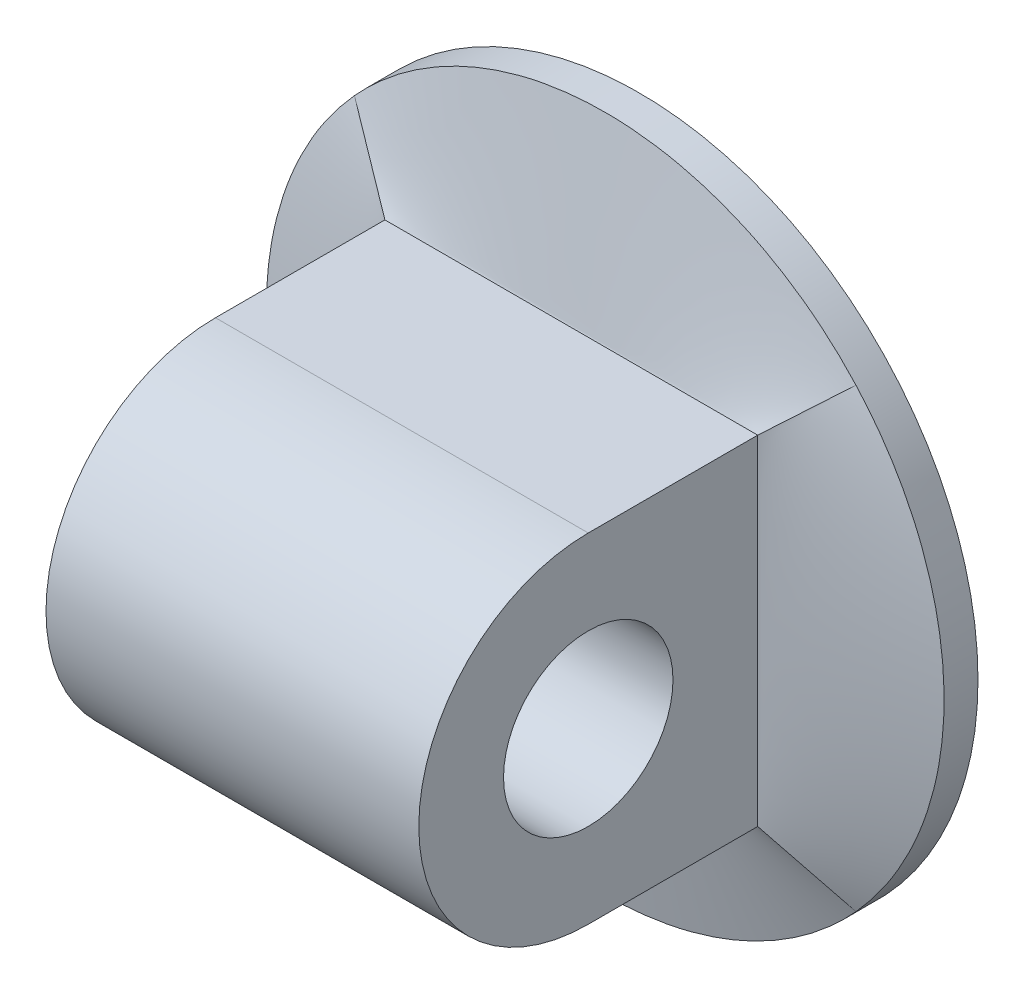
ISO-10303-21;
HEADER;
FILE_DESCRIPTION(('STEP AP214'),'2;1');
FILE_NAME('part.step','',(''),(''),'','','');
FILE_SCHEMA(('AUTOMOTIVE_DESIGN { 1 0 10303 214 1 1 1 1 }'));
ENDSEC;
DATA;
#1=APPLICATION_CONTEXT('core data for automotive mechanical design processes');
#2=APPLICATION_PROTOCOL_DEFINITION('international standard','automotive_design',2000,#1);
#3=PRODUCT_CONTEXT('',#1,'mechanical');
#4=PRODUCT('Part','Part','',(#3));
#5=PRODUCT_RELATED_PRODUCT_CATEGORY('part','',(#4));
#6=PRODUCT_DEFINITION_FORMATION('','',#4);
#7=PRODUCT_DEFINITION_CONTEXT('part definition',#1,'design');
#8=PRODUCT_DEFINITION('design','',#6,#7);
#9=PRODUCT_DEFINITION_SHAPE('','',#8);
#10=(LENGTH_UNIT() NAMED_UNIT(*) SI_UNIT(.MILLI.,.METRE.));
#11=(NAMED_UNIT(*) PLANE_ANGLE_UNIT() SI_UNIT($,.RADIAN.));
#12=(NAMED_UNIT(*) SI_UNIT($,.STERADIAN.) SOLID_ANGLE_UNIT());
#13=UNCERTAINTY_MEASURE_WITH_UNIT(LENGTH_MEASURE(1.E-05),#10,'distance_accuracy_value','');
#14=(GEOMETRIC_REPRESENTATION_CONTEXT(3) GLOBAL_UNCERTAINTY_ASSIGNED_CONTEXT((#13)) GLOBAL_UNIT_ASSIGNED_CONTEXT((#10,
#11,#12)) REPRESENTATION_CONTEXT('',''));
#15=CARTESIAN_POINT('',(0.,0.,0.));
#16=DIRECTION('',(0.,0.,1.));
#17=DIRECTION('',(1.,0.,0.));
#18=AXIS2_PLACEMENT_3D('',#15,#16,#17);
#19=CARTESIAN_POINT('',(-13.97,-12.7,30.48));
#20=DIRECTION('',(0.,1.,0.));
#21=DIRECTION('',(0.,0.,1.));
#22=AXIS2_PLACEMENT_3D('',#19,#20,#21);
#23=PLANE('',#22);
#24=DIRECTION('',(1.,0.,0.));
#25=VECTOR('',#24,1.);
#26=CARTESIAN_POINT('',(-25.4,-12.7,17.78));
#27=LINE('',#26,#25);
#28=CARTESIAN_POINT('',(-13.97,-12.7,17.78));
#29=VERTEX_POINT('',#28);
#30=CARTESIAN_POINT('',(13.97,-12.7,17.78));
#31=VERTEX_POINT('',#30);
#32=EDGE_CURVE('E129',#29,#31,#27,.T.);
#33=ORIENTED_EDGE('',*,*,#32,.F.);
#34=DIRECTION('',(0.,0.,-1.));
#35=VECTOR('',#34,1.);
#36=CARTESIAN_POINT('',(-13.97,-12.7,30.48));
#37=LINE('',#36,#35);
#38=CARTESIAN_POINT('',(-13.97,-12.7,5.08));
#39=VERTEX_POINT('',#38);
#40=EDGE_CURVE('E146',#29,#39,#37,.T.);
#41=ORIENTED_EDGE('',*,*,#40,.T.);
#42=DIRECTION('',(1.,0.,0.));
#43=VECTOR('',#42,1.);
#44=CARTESIAN_POINT('',(-13.97,-12.7,5.08));
#45=LINE('',#44,#43);
#46=CARTESIAN_POINT('',(13.97,-12.7,5.08));
#47=VERTEX_POINT('',#46);
#48=EDGE_CURVE('E140',#39,#47,#45,.T.);
#49=ORIENTED_EDGE('',*,*,#48,.T.);
#50=DIRECTION('',(0.,0.,-1.));
#51=VECTOR('',#50,1.);
#52=CARTESIAN_POINT('',(13.97,-12.7,30.48));
#53=LINE('',#52,#51);
#54=EDGE_CURVE('E66',#31,#47,#53,.T.);
#55=ORIENTED_EDGE('',*,*,#54,.F.);
#56=EDGE_LOOP('',(#33,#41,#49,#55));
#57=FACE_BOUND('',#56,.T.);
#58=ADVANCED_FACE('F61',(#57),#23,.F.);
#59=CARTESIAN_POINT('',(13.97,-12.7,30.48));
#60=DIRECTION('',(-1.,0.,0.));
#61=DIRECTION('',(0.,-1.,0.));
#62=AXIS2_PLACEMENT_3D('',#59,#60,#61);
#63=PLANE('',#62);
#64=CARTESIAN_POINT('',(13.97,0.,17.78));
#65=DIRECTION('',(-1.,0.,0.));
#66=DIRECTION('',(0.,-1.,0.));
#67=AXIS2_PLACEMENT_3D('',#64,#65,#66);
#68=CIRCLE('',#67,6.35);
#69=CARTESIAN_POINT('',(13.97,-6.35,17.78));
#70=VERTEX_POINT('',#69);
#71=EDGE_CURVE('E440',#70,#70,#68,.T.);
#72=ORIENTED_EDGE('',*,*,#71,.T.);
#73=EDGE_LOOP('',(#72));
#74=FACE_BOUND('',#73,.T.);
#75=CARTESIAN_POINT('',(13.97,0.,17.78));
#76=DIRECTION('',(-1.,0.,0.));
#77=DIRECTION('',(0.,1.,0.));
#78=AXIS2_PLACEMENT_3D('',#75,#76,#77);
#79=CIRCLE('',#78,12.7);
#80=CARTESIAN_POINT('',(13.97,12.7,17.78));
#81=VERTEX_POINT('',#80);
#82=EDGE_CURVE('E121',#31,#81,#79,.T.);
#83=ORIENTED_EDGE('',*,*,#82,.F.);
#84=ORIENTED_EDGE('',*,*,#54,.T.);
#85=DIRECTION('',(0.,1.,0.));
#86=VECTOR('',#85,1.);
#87=CARTESIAN_POINT('',(13.97,12.7,5.08));
#88=LINE('',#87,#86);
#89=CARTESIAN_POINT('',(13.97,12.7,5.08));
#90=VERTEX_POINT('',#89);
#91=EDGE_CURVE('E142',#47,#90,#88,.T.);
#92=ORIENTED_EDGE('',*,*,#91,.T.);
#93=DIRECTION('',(0.,0.,-1.));
#94=VECTOR('',#93,1.);
#95=CARTESIAN_POINT('',(13.97,12.7,30.48));
#96=LINE('',#95,#94);
#97=EDGE_CURVE('E98',#81,#90,#96,.T.);
#98=ORIENTED_EDGE('',*,*,#97,.F.);
#99=EDGE_LOOP('',(#83,#84,#92,#98));
#100=FACE_BOUND('',#99,.T.);
#101=ADVANCED_FACE('F123',(#74,#100),#63,.F.);
#102=CARTESIAN_POINT('',(-13.97,12.7,30.48));
#103=DIRECTION('',(1.,0.,0.));
#104=DIRECTION('',(0.,1.,0.));
#105=AXIS2_PLACEMENT_3D('',#102,#103,#104);
#106=PLANE('',#105);
#107=CARTESIAN_POINT('',(-13.97,0.,17.78));
#108=DIRECTION('',(1.,0.,0.));
#109=DIRECTION('',(0.,1.,0.));
#110=AXIS2_PLACEMENT_3D('',#107,#108,#109);
#111=CIRCLE('',#110,6.35);
#112=CARTESIAN_POINT('',(-13.97,6.35,17.78));
#113=VERTEX_POINT('',#112);
#114=EDGE_CURVE('E437',#113,#113,#111,.T.);
#115=ORIENTED_EDGE('',*,*,#114,.T.);
#116=EDGE_LOOP('',(#115));
#117=FACE_BOUND('',#116,.T.);
#118=ORIENTED_EDGE('',*,*,#40,.F.);
#119=CARTESIAN_POINT('',(-13.97,0.,17.78));
#120=DIRECTION('',(1.,0.,0.));
#121=DIRECTION('',(0.,1.,0.));
#122=AXIS2_PLACEMENT_3D('',#119,#120,#121);
#123=CIRCLE('',#122,12.7);
#124=CARTESIAN_POINT('',(-13.97,12.7,17.78));
#125=VERTEX_POINT('',#124);
#126=EDGE_CURVE('E134',#29,#125,#123,.F.);
#127=ORIENTED_EDGE('',*,*,#126,.T.);
#128=DIRECTION('',(0.,0.,-1.));
#129=VECTOR('',#128,1.);
#130=CARTESIAN_POINT('',(-13.97,12.7,30.48));
#131=LINE('',#130,#129);
#132=CARTESIAN_POINT('',(-13.97,12.7,5.08));
#133=VERTEX_POINT('',#132);
#134=EDGE_CURVE('E144',#125,#133,#131,.T.);
#135=ORIENTED_EDGE('',*,*,#134,.T.);
#136=DIRECTION('',(0.,-1.,0.));
#137=VECTOR('',#136,1.);
#138=CARTESIAN_POINT('',(-13.97,12.7,5.08));
#139=LINE('',#138,#137);
#140=EDGE_CURVE('E193',#133,#39,#139,.T.);
#141=ORIENTED_EDGE('',*,*,#140,.T.);
#142=EDGE_LOOP('',(#118,#127,#135,#141));
#143=FACE_BOUND('',#142,.T.);
#144=ADVANCED_FACE('F173',(#117,#143),#106,.F.);
#145=CARTESIAN_POINT('',(13.97,12.7,30.48));
#146=DIRECTION('',(0.,-1.,0.));
#147=DIRECTION('',(0.,0.,-1.));
#148=AXIS2_PLACEMENT_3D('',#145,#146,#147);
#149=PLANE('',#148);
#150=DIRECTION('',(1.,0.,0.));
#151=VECTOR('',#150,1.);
#152=CARTESIAN_POINT('',(-25.4,12.7,17.78));
#153=LINE('',#152,#151);
#154=EDGE_CURVE('E128',#125,#81,#153,.T.);
#155=ORIENTED_EDGE('',*,*,#154,.T.);
#156=ORIENTED_EDGE('',*,*,#97,.T.);
#157=DIRECTION('',(-1.,0.,0.));
#158=VECTOR('',#157,1.);
#159=CARTESIAN_POINT('',(-13.97,12.7,5.08));
#160=LINE('',#159,#158);
#161=EDGE_CURVE('E155',#90,#133,#160,.T.);
#162=ORIENTED_EDGE('',*,*,#161,.T.);
#163=ORIENTED_EDGE('',*,*,#134,.F.);
#164=EDGE_LOOP('',(#155,#156,#162,#163));
#165=FACE_BOUND('',#164,.T.);
#166=ADVANCED_FACE('F175',(#165),#149,.F.);
#167=CARTESIAN_POINT('',(0.,0.,0.));
#168=DIRECTION('',(0.,0.,1.));
#169=DIRECTION('',(1.,0.,0.));
#170=AXIS2_PLACEMENT_3D('',#167,#168,#169);
#171=PLANE('',#170);
#172=CARTESIAN_POINT('',(0.,0.,0.));
#173=DIRECTION('',(0.,0.,1.));
#174=DIRECTION('',(1.,0.,0.));
#175=AXIS2_PLACEMENT_3D('',#172,#173,#174);
#176=CIRCLE('',#175,25.4);
#177=CARTESIAN_POINT('',(25.4,0.,0.));
#178=VERTEX_POINT('',#177);
#179=EDGE_CURVE('E73',#178,#178,#176,.T.);
#180=ORIENTED_EDGE('',*,*,#179,.F.);
#181=EDGE_LOOP('',(#180));
#182=FACE_BOUND('',#181,.T.);
#183=CARTESIAN_POINT('',(0.,0.,0.));
#184=DIRECTION('',(0.,0.,1.));
#185=DIRECTION('',(1.,0.,0.));
#186=AXIS2_PLACEMENT_3D('',#183,#184,#185);
#187=CIRCLE('',#186,19.05);
#188=CARTESIAN_POINT('',(19.05,0.,0.));
#189=VERTEX_POINT('',#188);
#190=EDGE_CURVE('E203',#189,#189,#187,.T.);
#191=ORIENTED_EDGE('',*,*,#190,.T.);
#192=EDGE_LOOP('',(#191));
#193=FACE_BOUND('',#192,.T.);
#194=ADVANCED_FACE('F383',(#182,#193),#171,.F.);
#195=CARTESIAN_POINT('',(0.,0.,2.54));
#196=DIRECTION('',(0.,0.,-1.));
#197=DIRECTION('',(-1.,0.,0.));
#198=AXIS2_PLACEMENT_3D('',#195,#196,#197);
#199=CYLINDRICAL_SURFACE('',#198,25.4);
#200=CARTESIAN_POINT('',(18.794477836898,17.0858889976012,2.54));
#201=CARTESIAN_POINT('',(18.4741081322708,17.4383181520115,2.53998670058912));
#202=CARTESIAN_POINT('',(18.1438052176384,17.7817147573798,2.53997160410562));
#203=CARTESIAN_POINT('',(17.4644403885999,18.4493885223562,2.53995224649061));
#204=CARTESIAN_POINT('',(17.1153793663799,18.7736665897577,2.53994798484422));
#205=CARTESIAN_POINT('',(16.3995810203848,19.4020774144182,2.53996472225529));
#206=CARTESIAN_POINT('',(16.0328439897686,19.7062105055858,2.53998572089394));
#207=CARTESIAN_POINT('',(15.2831502229953,20.2931458219555,2.53999988643314));
#208=CARTESIAN_POINT('',(14.900206515286,20.5759646913553,2.5399930752845));
#209=CARTESIAN_POINT('',(14.1190329036444,21.1196435131953,2.53996159065939));
#210=CARTESIAN_POINT('',(13.7208031622574,21.3805036990409,2.53993691737282));
#211=CARTESIAN_POINT('',(12.9103480259254,21.8794291070963,2.53992679410293));
#212=CARTESIAN_POINT('',(12.498122710266,22.1174944584107,2.53994134389746));
#213=CARTESIAN_POINT('',(11.4513332993969,22.6833998153156,2.53997855551533));
#214=CARTESIAN_POINT('',(10.8087455547502,22.9965410034814,2.54000163287299));
#215=CARTESIAN_POINT('',(9.49952430891212,23.5675457495907,2.53996899602837));
#216=CARTESIAN_POINT('',(8.83289056283515,23.825408744393,2.53991328102344));
#217=CARTESIAN_POINT('',(7.48034063394357,24.2840340703429,2.53991792678306));
#218=CARTESIAN_POINT('',(6.79442695379282,24.4848037753106,2.53997827255008));
#219=CARTESIAN_POINT('',(5.40813265090926,24.8278471278146,2.5400002207297));
#220=CARTESIAN_POINT('',(4.70775209661901,24.970121052027,2.53996182360933));
#221=CARTESIAN_POINT('',(3.29745996008106,25.1951715308712,2.53991380422496));
#222=CARTESIAN_POINT('',(2.5875479130394,25.2779451732167,2.53990418336935));
#223=CARTESIAN_POINT('',(1.16327269574131,25.3833945718074,2.53994909332478));
#224=CARTESIAN_POINT('',(0.448909513455012,25.4060701655577,2.54000362430928));
#225=CARTESIAN_POINT('',(-0.979210274696633,25.3911618565037,2.53999044261568));
#226=CARTESIAN_POINT('',(-1.69296686077316,25.3535760580155,2.53992272609195));
#227=CARTESIAN_POINT('',(-3.11477354372304,25.2184085995299,2.53989880081427));
#228=CARTESIAN_POINT('',(-3.82282366569618,25.1208272035682,2.53994259156958));
#229=CARTESIAN_POINT('',(-5.22816838994491,24.8663665845274,2.53998663228571));
#230=CARTESIAN_POINT('',(-5.9254632486275,24.7094887773643,2.53998688328612));
#231=CARTESIAN_POINT('',(-7.30437297855121,24.3375440931514,2.53994773976558));
#232=CARTESIAN_POINT('',(-7.98598762546349,24.1224763841692,2.53990834467778));
#233=CARTESIAN_POINT('',(-9.32867670987712,23.6356893988476,2.53993080582025));
#234=CARTESIAN_POINT('',(-9.98975062948725,23.3639686954517,2.53999266460131));
#235=CARTESIAN_POINT('',(-11.2866857153269,22.7657750333189,2.5400066783914));
#236=CARTESIAN_POINT('',(-11.9225481463568,22.4393048255425,2.53995883891083));
#237=CARTESIAN_POINT('',(-12.9317455341005,21.8661735702151,2.53992752585472));
#238=CARTESIAN_POINT('',(-13.3142092719473,21.63541760312,2.53992665569328));
#239=CARTESIAN_POINT('',(-14.0664495264032,21.1540615217086,2.53995288366068));
#240=CARTESIAN_POINT('',(-14.4362265930037,20.9034622691986,2.5399799805755));
#241=CARTESIAN_POINT('',(-15.1620432661535,20.3831266107754,2.54000211464977));
#242=CARTESIAN_POINT('',(-15.5180830899075,20.1133905076338,2.53999715231631));
#243=CARTESIAN_POINT('',(-16.2155377244852,19.5554550770626,2.53997554980984));
#244=CARTESIAN_POINT('',(-16.556948878778,19.2672511778953,2.53995890673499));
#245=CARTESIAN_POINT('',(-17.2241090199499,18.6732302007118,2.53994824291605));
#246=CARTESIAN_POINT('',(-17.5498574579996,18.3674125063234,2.53995422296408));
#247=CARTESIAN_POINT('',(-18.1848091260737,17.7390080328659,2.53997447542128));
#248=CARTESIAN_POINT('',(-18.4940110062998,17.4164198899533,2.53998874850583));
#249=CARTESIAN_POINT('',(-18.7944778338648,17.0858890009377,2.54));
#250=B_SPLINE_CURVE_WITH_KNOTS('',3,(#200,#201,#202,#203,#204,#205,#206,#207,#208,#209,#210,
#211,#212,#213,#214,#215,#216,#217,#218,#219,#220,#221,#222,#223,#224,#225,#226,#227,#228,#229,
#230,#231,#232,#233,#234,#235,#236,#237,#238,#239,#240,#241,#242,#243,#244,#245,#246,#247,#248,
#249),.UNSPECIFIED.,.F.,.F.,(4,2,2,2,2,2,2,2,2,2,2,2,2,2,2,2,2,2,2,2,2,2,2,2,4),(0.,
1.42864991272389,2.85723193505403,4.28579027231223,5.71322123904431,7.14063703126579,
8.56804473845752,10.709827733685,12.8516325470838,14.9931606123114,17.1346785483226,
19.2763012954174,21.4179298330896,23.5596257427631,25.701312227078,27.8429475741229,
29.9846135414276,32.1263334625886,34.2679458024524,35.6074452409507,36.9468865360188,
38.2863066439891,39.6260596185607,40.9658595045812,42.3057685197337),.UNSPECIFIED.);
#251=CARTESIAN_POINT('',(18.794477836898,17.0858889976012,2.54));
#252=VERTEX_POINT('',#251);
#253=CARTESIAN_POINT('',(-18.7944778490609,17.085888984222,2.54));
#254=VERTEX_POINT('',#253);
#255=EDGE_CURVE('E12',#252,#254,#250,.T.);
#256=ORIENTED_EDGE('',*,*,#255,.F.);
#257=CARTESIAN_POINT('',(18.7944778339985,-17.0858890007907,2.54));
#258=CARTESIAN_POINT('',(19.1148552372747,-16.7334963516884,2.53998615729735));
#259=CARTESIAN_POINT('',(19.4252980022435,-16.3720745315598,2.53997354229119));
#260=CARTESIAN_POINT('',(20.0253700612826,-15.6323749928818,2.53996018744507));
#261=CARTESIAN_POINT('',(20.315000340815,-15.2540980737901,2.53995944704248));
#262=CARTESIAN_POINT('',(20.8725291774059,-14.481863524659,2.53997925791666));
#263=CARTESIAN_POINT('',(21.1404280924387,-14.0879061530786,2.53999980884262));
#264=CARTESIAN_POINT('',(21.6534759629399,-13.2858362987777,2.53999949905967));
#265=CARTESIAN_POINT('',(21.8986406673277,-12.8777338882421,2.53997866724601));
#266=CARTESIAN_POINT('',(22.365655752227,-12.048398232131,2.5399517935594));
#267=CARTESIAN_POINT('',(22.5875063799807,-11.6271651258659,2.53994575152958));
#268=CARTESIAN_POINT('',(23.0071843888881,-10.77292803668,2.53996450676354));
#269=CARTESIAN_POINT('',(23.2050119065518,-10.3399241206633,2.53998930385205));
#270=CARTESIAN_POINT('',(23.6689108964065,-9.24404845235492,2.54000143149694));
#271=CARTESIAN_POINT('',(23.9195840182419,-8.57459325218451,2.53996379904569));
#272=CARTESIAN_POINT('',(24.3636282885683,-7.21690475575948,2.53994015513534));
#273=CARTESIAN_POINT('',(24.5569988407875,-6.52867126418553,2.53995414421337));
#274=CARTESIAN_POINT('',(24.8030099302572,-5.48618802505693,2.53998819063604));
#275=CARTESIAN_POINT('',(24.8776721730458,-5.13700924601206,2.54000171632491));
#276=CARTESIAN_POINT('',(25.0122168185179,-4.43581564581108,2.53999776877882));
#277=CARTESIAN_POINT('',(25.0720991577913,-4.08380081249419,2.53998029541087));
#278=CARTESIAN_POINT('',(25.2293880580765,-3.02447045092621,2.53994341619974));
#279=CARTESIAN_POINT('',(25.3044744213476,-2.31370828842469,2.53993953602553));
#280=CARTESIAN_POINT('',(25.3944959670019,-0.888541160693621,2.5399670560185));
#281=CARTESIAN_POINT('',(25.4094364655733,-0.17413652300519,2.53999845306726));
#282=CARTESIAN_POINT('',(25.3790970768264,1.25342360773657,2.53998316414737));
#283=CARTESIAN_POINT('',(25.3338166766719,1.96657909010041,2.53993647751377));
#284=CARTESIAN_POINT('',(25.1833181409235,3.38683943814419,2.53994387347317));
#285=CARTESIAN_POINT('',(25.0780743891665,4.09394158673442,2.53999799915534));
#286=CARTESIAN_POINT('',(24.8083839171741,5.49674544031108,2.54000159547655));
#287=CARTESIAN_POINT('',(24.6439388513353,6.19244746330913,2.53995106903994));
#288=CARTESIAN_POINT('',(24.2569293519378,7.56782466595902,2.53994107139059));
#289=CARTESIAN_POINT('',(24.0343392707271,8.2474926284093,2.53998164042002));
#290=CARTESIAN_POINT('',(23.5326280585574,9.58572410605987,2.53999574506528));
#291=CARTESIAN_POINT('',(23.2535005193994,10.2442852191099,2.53996927307848));
#292=CARTESIAN_POINT('',(22.6410991001246,11.5347351089087,2.53995619650382));
#293=CARTESIAN_POINT('',(22.3078917313231,12.1666554627694,2.53996954329005));
#294=CARTESIAN_POINT('',(21.5895892492511,13.3999470436949,2.53998498500808));
#295=CARTESIAN_POINT('',(21.2045172754909,14.0013317304926,2.53998708494077));
#296=CARTESIAN_POINT('',(20.4879039190203,15.0230364579454,2.53997054365309));
#297=CARTESIAN_POINT('',(20.1671439585744,15.4509524464174,2.53995697019862));
#298=CARTESIAN_POINT('',(19.666581079206,16.0765907704683,2.53996719025171));
#299=CARTESIAN_POINT('',(19.4966448654611,16.282260172649,2.53997567314098));
#300=CARTESIAN_POINT('',(19.1503397905381,16.688189885001,2.539991509361));
#301=CARTESIAN_POINT('',(18.9739694941478,16.8884489707702,2.53999886243779));
#302=CARTESIAN_POINT('',(18.794477836898,17.0858889976012,2.54));
#303=B_SPLINE_CURVE_WITH_KNOTS('',3,(#257,#258,#259,#260,#261,#262,#263,#264,#265,#266,#267,
#268,#269,#270,#271,#272,#273,#274,#275,#276,#277,#278,#279,#280,#281,#282,#283,#284,#285,#286,
#287,#288,#289,#290,#291,#292,#293,#294,#295,#296,#297,#298,#299,#300,#301,#302),.UNSPECIFIED.,
.F.,.F.,(4,2,2,2,2,2,2,2,2,2,2,2,2,2,2,2,2,2,2,2,2,2,4),(0.,1.42858449794365,2.85710130838938,
4.28559458251196,5.71309077030487,7.14057181820005,8.56804475412839,10.709952572165,
12.8518826774057,13.9228207177047,14.9937633525494,17.1351546613628,19.2763566921735,
21.4175769574013,23.5597126320562,25.7017884487975,27.8448107311753,29.9880760489858,
32.1287251240026,34.2684222878233,35.8717038249667,36.6719624993108,37.4724007873769),.UNSPECIFIED.);
#304=CARTESIAN_POINT('',(18.7944778339985,-17.0858890007907,2.54));
#305=VERTEX_POINT('',#304);
#306=EDGE_CURVE('E81',#305,#252,#303,.T.);
#307=ORIENTED_EDGE('',*,*,#306,.F.);
#308=CARTESIAN_POINT('',(-18.794477836898,-17.0858889976012,2.54));
#309=CARTESIAN_POINT('',(-18.4741081322708,-17.4383181520115,2.53998670058913));
#310=CARTESIAN_POINT('',(-18.1438052176384,-17.7817147573798,2.53997160410563));
#311=CARTESIAN_POINT('',(-17.4644403885999,-18.4493885223562,2.53995224649061));
#312=CARTESIAN_POINT('',(-17.1153793663799,-18.7736665897577,2.53994798484422));
#313=CARTESIAN_POINT('',(-16.3995810203848,-19.4020774144182,2.53996472225529));
#314=CARTESIAN_POINT('',(-16.0328439897686,-19.7062105055858,2.53998572089394));
#315=CARTESIAN_POINT('',(-15.2831502229953,-20.2931458219555,2.53999988643314));
#316=CARTESIAN_POINT('',(-14.900206515286,-20.5759646913553,2.5399930752845));
#317=CARTESIAN_POINT('',(-14.1190329036444,-21.1196435131953,2.53996159065939));
#318=CARTESIAN_POINT('',(-13.7208031622574,-21.3805036990409,2.53993691737282));
#319=CARTESIAN_POINT('',(-12.9103480259255,-21.8794291070962,2.53992679410293));
#320=CARTESIAN_POINT('',(-12.498122710266,-22.1174944584107,2.53994134389746));
#321=CARTESIAN_POINT('',(-11.4513332993969,-22.6833998153156,2.53997855551533));
#322=CARTESIAN_POINT('',(-10.8087455547503,-22.9965410034814,2.54000163287299));
#323=CARTESIAN_POINT('',(-9.49952430891215,-23.5675457495907,2.53996899602837));
#324=CARTESIAN_POINT('',(-8.83289056283518,-23.8254087443929,2.53991328102344));
#325=CARTESIAN_POINT('',(-7.48034063394361,-24.2840340703429,2.53991792678305));
#326=CARTESIAN_POINT('',(-6.79442695379286,-24.4848037753106,2.53997827255008));
#327=CARTESIAN_POINT('',(-5.4081326509093,-24.8278471278146,2.54000022072969));
#328=CARTESIAN_POINT('',(-4.70775209661904,-24.970121052027,2.53996182360933));
#329=CARTESIAN_POINT('',(-3.29745996008109,-25.1951715308712,2.53991380422496));
#330=CARTESIAN_POINT('',(-2.58754791303942,-25.2779451732167,2.53990418336935));
#331=CARTESIAN_POINT('',(-1.16327269574133,-25.3833945718074,2.53994909332479));
#332=CARTESIAN_POINT('',(-0.448909513455027,-25.4060701655577,2.54000362430928));
#333=CARTESIAN_POINT('',(0.979210274696619,-25.3911618565037,2.53999044261568));
#334=CARTESIAN_POINT('',(1.69296686077314,-25.3535760580155,2.53992272609195));
#335=CARTESIAN_POINT('',(3.11477354372302,-25.2184085995299,2.53989880081427));
#336=CARTESIAN_POINT('',(3.82282366569615,-25.1208272035682,2.53994259156958));
#337=CARTESIAN_POINT('',(5.22816838994486,-24.8663665845274,2.5399866322857));
#338=CARTESIAN_POINT('',(5.92546324862744,-24.7094887773643,2.53998688328612));
#339=CARTESIAN_POINT('',(7.30437297855112,-24.3375440931514,2.53994773976558));
#340=CARTESIAN_POINT('',(7.98598762546339,-24.1224763841693,2.53990834467778));
#341=CARTESIAN_POINT('',(9.32867670987701,-23.6356893988476,2.53993080582024));
#342=CARTESIAN_POINT('',(9.98975062948715,-23.3639686954517,2.5399926646013));
#343=CARTESIAN_POINT('',(11.2866857153268,-22.7657750333189,2.54000667839139));
#344=CARTESIAN_POINT('',(11.9225481463567,-22.4393048255425,2.53995883891082));
#345=CARTESIAN_POINT('',(12.9317455341101,-21.8661735702097,2.53992752585471));
#346=CARTESIAN_POINT('',(13.3142092719661,-21.6354176031087,2.53992665569328));
#347=CARTESIAN_POINT('',(14.0664495264399,-21.1540615216844,2.53995288366068));
#348=CARTESIAN_POINT('',(14.436226593049,-20.9034622691675,2.5399799805755));
#349=CARTESIAN_POINT('',(15.1620432662153,-20.3831266107296,2.54000211464977));
#350=CARTESIAN_POINT('',(15.5180830899772,-20.1133905075802,2.53999715231632));
#351=CARTESIAN_POINT('',(16.21553772457,-19.5554550769925,2.53997554980984));
#352=CARTESIAN_POINT('',(16.55694887887,-19.2672511778165,2.53995890673499));
#353=CARTESIAN_POINT('',(17.2241090200554,-18.6732302006147,2.53994824291604));
#354=CARTESIAN_POINT('',(17.5498574581113,-18.3674125062169,2.53995422296409));
#355=CARTESIAN_POINT('',(18.1848091261971,-17.7390080327397,2.53997447542129));
#356=CARTESIAN_POINT('',(18.4940110064286,-17.4164198898168,2.53998874850584));
#357=CARTESIAN_POINT('',(18.7944778339985,-17.0858890007907,2.54));
#358=B_SPLINE_CURVE_WITH_KNOTS('',3,(#308,#309,#310,#311,#312,#313,#314,#315,#316,#317,#318,
#319,#320,#321,#322,#323,#324,#325,#326,#327,#328,#329,#330,#331,#332,#333,#334,#335,#336,#337,
#338,#339,#340,#341,#342,#343,#344,#345,#346,#347,#348,#349,#350,#351,#352,#353,#354,#355,#356,
#357),.UNSPECIFIED.,.F.,.F.,(4,2,2,2,2,2,2,2,2,2,2,2,2,2,2,2,2,2,2,2,2,2,2,2,4),(0.,
1.42864991272389,2.85723193505403,4.28579027231223,5.71322123904431,7.14063703126578,
8.56804473845751,10.709827733685,12.8516325470837,14.9931606123113,17.1346785483226,
19.2763012954174,21.4179298330896,23.5596257427631,25.701312227078,27.8429475741228,
29.9846135414275,32.1263334625885,34.2679458024524,35.6074452409836,36.9468865360847,
38.286306644088,39.6260596186928,40.9658595047466,42.3057685199324),.UNSPECIFIED.);
#359=CARTESIAN_POINT('',(-18.794477836898,-17.0858889976012,2.54));
#360=VERTEX_POINT('',#359);
#361=EDGE_CURVE('E296',#360,#305,#358,.T.);
#362=ORIENTED_EDGE('',*,*,#361,.F.);
#363=CARTESIAN_POINT('',(-18.7944778338648,17.0858890009377,2.54));
#364=CARTESIAN_POINT('',(-19.1148552371438,16.733496351838,2.53998615729736));
#365=CARTESIAN_POINT('',(-19.4252980021154,16.3720745317117,2.5399735422912));
#366=CARTESIAN_POINT('',(-20.0253700611603,15.6323749930385,2.53996018744507));
#367=CARTESIAN_POINT('',(-20.3150003406957,15.2540980739491,2.53995944704248));
#368=CARTESIAN_POINT('',(-20.8725291772926,14.4818635248223,2.53997925791665));
#369=CARTESIAN_POINT('',(-21.1404280923285,14.087906153244,2.53999980884261));
#370=CARTESIAN_POINT('',(-21.653475962836,13.2858362989471,2.53999949905967));
#371=CARTESIAN_POINT('',(-21.8986406672269,12.8777338884134,2.53997866724601));
#372=CARTESIAN_POINT('',(-22.3656557521328,12.048398232306,2.5399517935594));
#373=CARTESIAN_POINT('',(-22.5875063798898,11.6271651260427,2.53994575152959));
#374=CARTESIAN_POINT('',(-23.0071843888038,10.7729280368601,2.53996450676354));
#375=CARTESIAN_POINT('',(-23.2050119064709,10.3399241208449,2.53998930385205));
#376=CARTESIAN_POINT('',(-23.6689108963342,9.2440484525401,2.54000143149694));
#377=CARTESIAN_POINT('',(-23.9195840181749,8.57459325237166,2.5399637990457));
#378=CARTESIAN_POINT('',(-24.3636282885118,7.21690475595011,2.53994015513534));
#379=CARTESIAN_POINT('',(-24.5569988407365,6.52867126437767,2.53995414421336));
#380=CARTESIAN_POINT('',(-24.8030099302143,5.486188025251,2.53998819063603));
#381=CARTESIAN_POINT('',(-24.8776721730056,5.13700924620672,2.54000171632491));
#382=CARTESIAN_POINT('',(-25.0122168184832,4.43581564600679,2.53999776877883));
#383=CARTESIAN_POINT('',(-25.0720991577594,4.08380081269036,2.53998029541088));
#384=CARTESIAN_POINT('',(-25.2293880580528,3.02447045112362,2.53994341619975));
#385=CARTESIAN_POINT('',(-25.3044744213295,2.31370828862268,2.53993953602553));
#386=CARTESIAN_POINT('',(-25.3944959669949,0.888541160892299,2.53996705601849));
#387=CARTESIAN_POINT('',(-25.4094364655719,0.174136523203977,2.53999845306727));
#388=CARTESIAN_POINT('',(-25.3790970768362,-1.25342360753803,2.53998316414738));
#389=CARTESIAN_POINT('',(-25.3338166766873,-1.96657908990223,2.53993647751377));
#390=CARTESIAN_POINT('',(-25.18331814095,-3.3868394379472,2.53994387347316));
#391=CARTESIAN_POINT('',(-25.0780743891985,-4.09394158653825,2.53999799915533));
#392=CARTESIAN_POINT('',(-24.8083839172171,-5.496745440117,2.54000159547655));
#393=CARTESIAN_POINT('',(-24.6439388513838,-6.19244746311633,2.53995106903994));
#394=CARTESIAN_POINT('',(-24.256929351997,-7.56782466576922,2.53994107139059));
#395=CARTESIAN_POINT('',(-24.0343392707917,-8.2474926282212,2.53998164042001));
#396=CARTESIAN_POINT('',(-23.5326280586324,-9.58572410587565,2.53999574506528));
#397=CARTESIAN_POINT('',(-23.2535005194796,-10.2442852189278,2.53996927307849));
#398=CARTESIAN_POINT('',(-22.6410991002149,-11.5347351087315,2.53995619650383));
#399=CARTESIAN_POINT('',(-22.3078917314183,-12.1666554625947,2.53996954329004));
#400=CARTESIAN_POINT('',(-21.589589249356,-13.399947043526,2.53998498500807));
#401=CARTESIAN_POINT('',(-21.2045172756005,-14.0013317303267,2.53998708494077));
#402=CARTESIAN_POINT('',(-20.4879039191188,-15.0230364578122,2.53997054365309));
#403=CARTESIAN_POINT('',(-20.1671439586555,-15.4509524463127,2.53995697019862));
#404=CARTESIAN_POINT('',(-19.6665810792585,-16.0765907704043,2.53996719025171));
#405=CARTESIAN_POINT('',(-19.4966448655037,-16.2822601725983,2.53997567314098));
#406=CARTESIAN_POINT('',(-19.15033979056,-16.6881898849761,2.539991509361));
#407=CARTESIAN_POINT('',(-18.9739694941589,-16.888448970758,2.53999886243779));
#408=CARTESIAN_POINT('',(-18.794477836898,-17.0858889976012,2.54));
#409=B_SPLINE_CURVE_WITH_KNOTS('',3,(#363,#364,#365,#366,#367,#368,#369,#370,#371,#372,#373,
#374,#375,#376,#377,#378,#379,#380,#381,#382,#383,#384,#385,#386,#387,#388,#389,#390,#391,#392,
#393,#394,#395,#396,#397,#398,#399,#400,#401,#402,#403,#404,#405,#406,#407,#408),.UNSPECIFIED.,
.F.,.F.,(4,2,2,2,2,2,2,2,2,2,2,2,2,2,2,2,2,2,2,2,2,2,4),(0.,1.42858449794365,2.8571013083894,
4.28559458251198,5.71309077030489,7.14057181820005,8.56804475412839,10.709952572165,
12.8518826774057,13.9228207177047,14.9937633525494,17.1351546613628,19.2763566921736,
21.4175769574014,23.5597126320562,25.7017884487975,27.8448107311752,29.9880760489856,
32.1287251240025,34.2684222878233,35.8717038250661,36.6719624994599,37.4724007875756),.UNSPECIFIED.);
#410=EDGE_CURVE('E89',#254,#360,#409,.T.);
#411=ORIENTED_EDGE('',*,*,#410,.F.);
#412=EDGE_LOOP('',(#256,#307,#362,#411));
#413=FACE_BOUND('',#412,.T.);
#414=ORIENTED_EDGE('',*,*,#179,.T.);
#415=EDGE_LOOP('',(#414));
#416=FACE_BOUND('',#415,.T.);
#417=ADVANCED_FACE('F63',(#413,#416),#199,.T.);
#418=CARTESIAN_POINT('',(0.,0.,2.54));
#419=DIRECTION('',(0.,0.,-1.));
#420=DIRECTION('',(-1.,0.,0.));
#421=AXIS2_PLACEMENT_3D('',#418,#419,#420);
#422=CYLINDRICAL_SURFACE('',#421,19.05);
#423=CARTESIAN_POINT('',(0.,0.,2.54));
#424=DIRECTION('',(0.,0.,1.));
#425=DIRECTION('',(1.,0.,0.));
#426=AXIS2_PLACEMENT_3D('',#423,#424,#425);
#427=CIRCLE('',#426,19.05);
#428=CARTESIAN_POINT('',(19.05,0.,2.54));
#429=VERTEX_POINT('',#428);
#430=EDGE_CURVE('E200',#429,#429,#427,.T.);
#431=ORIENTED_EDGE('',*,*,#430,.T.);
#432=EDGE_LOOP('',(#431));
#433=FACE_BOUND('',#432,.T.);
#434=ORIENTED_EDGE('',*,*,#190,.F.);
#435=EDGE_LOOP('',(#434));
#436=FACE_BOUND('',#435,.T.);
#437=ADVANCED_FACE('F289',(#433,#436),#422,.F.);
#438=CARTESIAN_POINT('',(0.,0.,2.54));
#439=DIRECTION('',(0.,0.,1.));
#440=DIRECTION('',(1.,0.,0.));
#441=AXIS2_PLACEMENT_3D('',#438,#439,#440);
#442=PLANE('',#441);
#443=ORIENTED_EDGE('',*,*,#430,.F.);
#444=EDGE_LOOP('',(#443));
#445=FACE_BOUND('',#444,.T.);
#446=ADVANCED_FACE('F181',(#445),#442,.F.);
#447=CARTESIAN_POINT('',(18.8427226428995,17.1297478571814,2.5146));
#448=CARTESIAN_POINT('',(18.794477864257,17.0858889675063,2.54));
#449=CARTESIAN_POINT('',(13.97,12.7,5.08));
#450=CARTESIAN_POINT('',(17.790284369898,18.3002357908164,2.5146));
#451=CARTESIAN_POINT('',(17.740933369536,18.2447879116994,2.54));
#452=CARTESIAN_POINT('',(12.8058333333333,12.7,5.08));
#453=CARTESIAN_POINT('',(16.5843733535692,19.4207493172467,2.5146));
#454=CARTESIAN_POINT('',(16.5354356635999,19.3542072447987,2.54));
#455=CARTESIAN_POINT('',(11.6416666666667,12.7,5.08));
#456=CARTESIAN_POINT('',(13.875745589174,21.4577472146018,2.5146));
#457=CARTESIAN_POINT('',(13.8305731906013,21.3710368461404,2.54));
#458=CARTESIAN_POINT('',(9.31333333333332,12.7,5.08));
#459=CARTESIAN_POINT('',(12.3727590956387,22.3734647470059,2.5146));
#460=CARTESIAN_POINT('',(12.3309413488172,22.2776878683226,2.54));
#461=CARTESIAN_POINT('',(8.14916666666666,12.7,5.08));
#462=CARTESIAN_POINT('',(9.12603953424932,23.8944251656399,2.5146));
#463=CARTESIAN_POINT('',(9.09331472037887,23.7835892729108,2.54));
#464=CARTESIAN_POINT('',(5.82083333333332,12.7,5.08));
#465=CARTESIAN_POINT('',(7.38256670304431,24.4987437570949,2.5146));
#466=CARTESIAN_POINT('',(7.35557759377325,24.3819245119752,2.54));
#467=CARTESIAN_POINT('',(4.65666666666666,12.7,5.08));
#468=CARTESIAN_POINT('',(3.75901673527852,25.3153561095672,2.5146));
#469=CARTESIAN_POINT('',(3.74485155308104,25.1904515936309,2.54));
#470=CARTESIAN_POINT('',(2.32833333333332,12.7,5.08));
#471=CARTESIAN_POINT('',(1.87978450975317,25.527,2.5146));
#472=CARTESIAN_POINT('',(1.87269918457409,25.4,2.54));
#473=CARTESIAN_POINT('',(1.16416666666666,12.7,5.08));
#474=CARTESIAN_POINT('',(-1.87978450975316,25.527,2.5146));
#475=CARTESIAN_POINT('',(-1.87269918457409,25.4,2.54));
#476=CARTESIAN_POINT('',(-1.16416666666667,12.7,5.08));
#477=CARTESIAN_POINT('',(-3.75901673527851,25.3153561095672,2.5146));
#478=CARTESIAN_POINT('',(-3.74485155308104,25.1904515936309,2.54));
#479=CARTESIAN_POINT('',(-2.32833333333334,12.7,5.08));
#480=CARTESIAN_POINT('',(-7.38256670304431,24.4987437570949,2.5146));
#481=CARTESIAN_POINT('',(-7.35557759377325,24.3819245119752,2.54));
#482=CARTESIAN_POINT('',(-4.65666666666667,12.7,5.08));
#483=CARTESIAN_POINT('',(-9.12603953424932,23.8944251656399,2.5146));
#484=CARTESIAN_POINT('',(-9.09331472037887,23.7835892729108,2.54));
#485=CARTESIAN_POINT('',(-5.82083333333334,12.7,5.08));
#486=CARTESIAN_POINT('',(-12.3727590956387,22.3734647470059,2.5146));
#487=CARTESIAN_POINT('',(-12.3309413488172,22.2776878683226,2.54));
#488=CARTESIAN_POINT('',(-8.14916666666667,12.7,5.08));
#489=CARTESIAN_POINT('',(-13.8757455891739,21.4577472146018,2.5146));
#490=CARTESIAN_POINT('',(-13.8305731906013,21.3710368461404,2.54));
#491=CARTESIAN_POINT('',(-9.31333333333334,12.7,5.08));
#492=CARTESIAN_POINT('',(-16.5843733535692,19.4207493172467,2.5146));
#493=CARTESIAN_POINT('',(-16.5354356635999,19.3542072447987,2.54));
#494=CARTESIAN_POINT('',(-11.6416666666667,12.7,5.08));
#495=CARTESIAN_POINT('',(-17.790284369898,18.3002357908164,2.5146));
#496=CARTESIAN_POINT('',(-17.740933369536,18.2447879116994,2.54));
#497=CARTESIAN_POINT('',(-12.8058333333333,12.7,5.08));
#498=CARTESIAN_POINT('',(-18.8427226428995,17.1297478571814,2.5146));
#499=CARTESIAN_POINT('',(-18.794477864257,17.0858889675063,2.54));
#500=CARTESIAN_POINT('',(-13.97,12.7,5.08));
#501=B_SPLINE_SURFACE_WITH_KNOTS('',3,1,((#447,#448,#449),(#450,#451,#452),(#453,#454,#455),
(#456,#457,#458),(#459,#460,#461),(#462,#463,#464),(#465,#466,#467),(#468,#469,#470),(#471,#472,
#473),(#474,#475,#476),(#477,#478,#479),(#480,#481,#482),(#483,#484,#485),(#486,#487,#488),
(#489,#490,#491),(#492,#493,#494),(#495,#496,#497),(#498,#499,#500)),.UNSPECIFIED.,.F.,.F.,.F.,
(4,2,2,2,2,2,2,2,4),(2,1,2),(0.,0.125,0.25,0.375,0.5,0.625,0.75,0.875,1.),(-0.01,0.,1.),.UNSPECIFIED.);
#502=DIRECTION('',(0.689470013902571,-0.62679092172961,0.362993443971837));
#503=VECTOR('',#502,1.);
#504=CARTESIAN_POINT('',(-16.3822389321285,14.8929444837532,3.81));
#505=LINE('',#504,#503);
#506=EDGE_CURVE('E305',#254,#133,#505,.T.);
#507=DIRECTION('',(0.689470013902571,0.626790921729609,-0.362993443971837));
#508=VECTOR('',#507,1.);
#509=CARTESIAN_POINT('',(16.3822389321285,14.8929444837532,3.81));
#510=LINE('',#509,#508);
#511=EDGE_CURVE('E262',#90,#252,#510,.T.);
#512=ORIENTED_EDGE('',*,*,#255,.T.);
#513=ORIENTED_EDGE('',*,*,#506,.T.);
#514=ORIENTED_EDGE('',*,*,#161,.F.);
#515=ORIENTED_EDGE('',*,*,#511,.T.);
#516=EDGE_LOOP('',(#512,#513,#514,#515));
#517=FACE_BOUND('',#516,.T.);
#518=ADVANCED_FACE('F216',(#517),#501,.T.);
#519=CARTESIAN_POINT('',(-18.8427226428995,17.1297478571814,2.5146));
#520=CARTESIAN_POINT('',(-18.794477864257,17.0858889675063,2.54));
#521=CARTESIAN_POINT('',(-13.97,12.7,5.08));
#522=CARTESIAN_POINT('',(-19.8100680425979,16.0762512508466,2.5146));
#523=CARTESIAN_POINT('',(-19.7522455867306,16.0323444727854,2.54));
#524=CARTESIAN_POINT('',(-13.97,11.6416666666667,5.08));
#525=CARTESIAN_POINT('',(-20.719499134954,14.9057142104198,2.5146));
#526=CARTESIAN_POINT('',(-20.6526724108455,14.8629183601516,2.54));
#527=CARTESIAN_POINT('',(-13.97,10.5833333333333,5.08));
#528=CARTESIAN_POINT('',(-22.350846284734,12.3502871339818,2.5146));
#529=CARTESIAN_POINT('',(-22.2678676086476,12.3118354461866,2.54));
#530=CARTESIAN_POINT('',(-13.97,8.46666666666668,5.08));
#531=CARTESIAN_POINT('',(-23.0723188467091,10.9653466124629,2.5146));
#532=CARTESIAN_POINT('',(-22.9821968779299,10.9301286592042,2.54));
#533=CARTESIAN_POINT('',(-13.97,7.40833333333335,5.08));
#534=CARTESIAN_POINT('',(-24.2600243747935,8.02917977560825,2.5146));
#535=CARTESIAN_POINT('',(-24.1581429453401,8.00207568542071,2.54));
#536=CARTESIAN_POINT('',(-13.97,5.29166666666669,5.08));
#537=CARTESIAN_POINT('',(-24.7257956639761,6.47816618075702,2.5146));
#538=CARTESIAN_POINT('',(-24.6193026376001,6.45594011296074,2.54));
#539=CARTESIAN_POINT('',(-13.97,4.23333333333336,5.08));
#540=CARTESIAN_POINT('',(-25.3530832281301,3.28455440626646,2.5146));
#541=CARTESIAN_POINT('',(-25.2403794337922,3.27299116131993,2.54));
#542=CARTESIAN_POINT('',(-13.97,2.11666666666669,5.08));
#543=CARTESIAN_POINT('',(-25.5143,1.64241879406182,2.5146));
#544=CARTESIAN_POINT('',(-25.4,1.63663576969817,2.54));
#545=CARTESIAN_POINT('',(-13.97,1.05833333333336,5.08));
#546=CARTESIAN_POINT('',(-25.5143,-1.64241879406181,2.5146));
#547=CARTESIAN_POINT('',(-25.4,-1.63663576969817,2.54));
#548=CARTESIAN_POINT('',(-13.97,-1.05833333333331,5.08));
#549=CARTESIAN_POINT('',(-25.3530832281301,-3.28455440626646,2.5146));
#550=CARTESIAN_POINT('',(-25.2403794337922,-3.27299116131993,2.54));
#551=CARTESIAN_POINT('',(-13.97,-2.11666666666664,5.08));
#552=CARTESIAN_POINT('',(-24.7257956639761,-6.47816618075701,2.5146));
#553=CARTESIAN_POINT('',(-24.6193026376001,-6.45594011296074,2.54));
#554=CARTESIAN_POINT('',(-13.97,-4.23333333333331,5.08));
#555=CARTESIAN_POINT('',(-24.2600243747935,-8.02917977560825,2.5146));
#556=CARTESIAN_POINT('',(-24.1581429453401,-8.00207568542071,2.54));
#557=CARTESIAN_POINT('',(-13.97,-5.29166666666664,5.08));
#558=CARTESIAN_POINT('',(-23.0723188467091,-10.9653466124629,2.5146));
#559=CARTESIAN_POINT('',(-22.9821968779299,-10.9301286592042,2.54));
#560=CARTESIAN_POINT('',(-13.97,-7.40833333333331,5.08));
#561=CARTESIAN_POINT('',(-22.350846284734,-12.3502871339818,2.5146));
#562=CARTESIAN_POINT('',(-22.2678676086476,-12.3118354461866,2.54));
#563=CARTESIAN_POINT('',(-13.97,-8.46666666666665,5.08));
#564=CARTESIAN_POINT('',(-20.719499134954,-14.9057142104198,2.5146));
#565=CARTESIAN_POINT('',(-20.6526724108455,-14.8629183601516,2.54));
#566=CARTESIAN_POINT('',(-13.97,-10.5833333333333,5.08));
#567=CARTESIAN_POINT('',(-19.8100680425979,-16.0762512508466,2.5146));
#568=CARTESIAN_POINT('',(-19.7522455867306,-16.0323444727854,2.54));
#569=CARTESIAN_POINT('',(-13.97,-11.6416666666667,5.08));
#570=CARTESIAN_POINT('',(-18.8427226428995,-17.1297478571814,2.5146));
#571=CARTESIAN_POINT('',(-18.794477864257,-17.0858889675063,2.54));
#572=CARTESIAN_POINT('',(-13.97,-12.7,5.08));
#573=B_SPLINE_SURFACE_WITH_KNOTS('',3,1,((#519,#520,#521),(#522,#523,#524),(#525,#526,#527),
(#528,#529,#530),(#531,#532,#533),(#534,#535,#536),(#537,#538,#539),(#540,#541,#542),(#543,#544,
#545),(#546,#547,#548),(#549,#550,#551),(#552,#553,#554),(#555,#556,#557),(#558,#559,#560),
(#561,#562,#563),(#564,#565,#566),(#567,#568,#569),(#570,#571,#572)),.UNSPECIFIED.,.F.,.F.,.F.,
(4,2,2,2,2,2,2,2,4),(2,1,2),(0.,0.125,0.25,0.375,0.5,0.625,0.75,0.875,1.),(-0.01,0.,1.),.UNSPECIFIED.);
#574=DIRECTION('',(0.68947001390257,0.62679092172961,0.362993443971837));
#575=VECTOR('',#574,1.);
#576=CARTESIAN_POINT('',(-16.3822389321285,-14.8929444837532,3.81));
#577=LINE('',#576,#575);
#578=EDGE_CURVE('E255',#360,#39,#577,.T.);
#579=ORIENTED_EDGE('',*,*,#410,.T.);
#580=ORIENTED_EDGE('',*,*,#578,.T.);
#581=ORIENTED_EDGE('',*,*,#140,.F.);
#582=ORIENTED_EDGE('',*,*,#506,.F.);
#583=EDGE_LOOP('',(#579,#580,#581,#582));
#584=FACE_BOUND('',#583,.T.);
#585=ADVANCED_FACE('F222',(#584),#573,.T.);
#586=CARTESIAN_POINT('',(18.8427226428995,-17.1297478571814,2.5146));
#587=CARTESIAN_POINT('',(18.794477864257,-17.0858889675063,2.54));
#588=CARTESIAN_POINT('',(13.97,-12.7,5.08));
#589=CARTESIAN_POINT('',(19.8100680425979,-16.0762512508466,2.5146));
#590=CARTESIAN_POINT('',(19.7522455867306,-16.0323444727854,2.54));
#591=CARTESIAN_POINT('',(13.97,-11.6416666666667,5.08));
#592=CARTESIAN_POINT('',(20.719499134954,-14.9057142104198,2.5146));
#593=CARTESIAN_POINT('',(20.6526724108455,-14.8629183601516,2.54));
#594=CARTESIAN_POINT('',(13.97,-10.5833333333333,5.08));
#595=CARTESIAN_POINT('',(22.350846284734,-12.3502871339818,2.5146));
#596=CARTESIAN_POINT('',(22.2678676086476,-12.3118354461866,2.54));
#597=CARTESIAN_POINT('',(13.97,-8.46666666666667,5.08));
#598=CARTESIAN_POINT('',(23.0723188467091,-10.9653466124629,2.5146));
#599=CARTESIAN_POINT('',(22.9821968779298,-10.9301286592042,2.54));
#600=CARTESIAN_POINT('',(13.97,-7.40833333333334,5.08));
#601=CARTESIAN_POINT('',(24.2600243747935,-8.02917977560825,2.5146));
#602=CARTESIAN_POINT('',(24.15814294534,-8.0020756854207,2.54));
#603=CARTESIAN_POINT('',(13.97,-5.29166666666667,5.08));
#604=CARTESIAN_POINT('',(24.7257956639761,-6.47816618075702,2.5146));
#605=CARTESIAN_POINT('',(24.6193026376001,-6.45594011296074,2.54));
#606=CARTESIAN_POINT('',(13.97,-4.23333333333334,5.08));
#607=CARTESIAN_POINT('',(25.3530832281301,-3.28455440626646,2.5146));
#608=CARTESIAN_POINT('',(25.2403794337922,-3.27299116131993,2.54));
#609=CARTESIAN_POINT('',(13.97,-2.11666666666668,5.08));
#610=CARTESIAN_POINT('',(25.5143,-1.64241879406182,2.5146));
#611=CARTESIAN_POINT('',(25.4,-1.63663576969817,2.54));
#612=CARTESIAN_POINT('',(13.97,-1.05833333333334,5.08));
#613=CARTESIAN_POINT('',(25.5143,1.64241879406181,2.5146));
#614=CARTESIAN_POINT('',(25.4,1.63663576969816,2.54));
#615=CARTESIAN_POINT('',(13.97,1.05833333333332,5.08));
#616=CARTESIAN_POINT('',(25.3530832281301,3.28455440626646,2.5146));
#617=CARTESIAN_POINT('',(25.2403794337922,3.27299116131992,2.54));
#618=CARTESIAN_POINT('',(13.97,2.11666666666666,5.08));
#619=CARTESIAN_POINT('',(24.7257956639761,6.47816618075701,2.5146));
#620=CARTESIAN_POINT('',(24.6193026376001,6.45594011296074,2.54));
#621=CARTESIAN_POINT('',(13.97,4.23333333333333,5.08));
#622=CARTESIAN_POINT('',(24.2600243747935,8.02917977560824,2.5146));
#623=CARTESIAN_POINT('',(24.1581429453401,8.0020756854207,2.54));
#624=CARTESIAN_POINT('',(13.97,5.29166666666666,5.08));
#625=CARTESIAN_POINT('',(23.0723188467091,10.9653466124629,2.5146));
#626=CARTESIAN_POINT('',(22.9821968779298,10.9301286592042,2.54));
#627=CARTESIAN_POINT('',(13.97,7.40833333333333,5.08));
#628=CARTESIAN_POINT('',(22.3508462847341,12.3502871339818,2.5146));
#629=CARTESIAN_POINT('',(22.2678676086476,12.3118354461866,2.54));
#630=CARTESIAN_POINT('',(13.97,8.46666666666666,5.08));
#631=CARTESIAN_POINT('',(20.719499134954,14.9057142104198,2.5146));
#632=CARTESIAN_POINT('',(20.6526724108455,14.8629183601516,2.54));
#633=CARTESIAN_POINT('',(13.97,10.5833333333333,5.08));
#634=CARTESIAN_POINT('',(19.8100680425979,16.0762512508465,2.5146));
#635=CARTESIAN_POINT('',(19.7522455867306,16.0323444727854,2.54));
#636=CARTESIAN_POINT('',(13.97,11.6416666666667,5.08));
#637=CARTESIAN_POINT('',(18.8427226428995,17.1297478571814,2.5146));
#638=CARTESIAN_POINT('',(18.794477864257,17.0858889675063,2.54));
#639=CARTESIAN_POINT('',(13.97,12.7,5.08));
#640=B_SPLINE_SURFACE_WITH_KNOTS('',3,1,((#586,#587,#588),(#589,#590,#591),(#592,#593,#594),
(#595,#596,#597),(#598,#599,#600),(#601,#602,#603),(#604,#605,#606),(#607,#608,#609),(#610,#611,
#612),(#613,#614,#615),(#616,#617,#618),(#619,#620,#621),(#622,#623,#624),(#625,#626,#627),
(#628,#629,#630),(#631,#632,#633),(#634,#635,#636),(#637,#638,#639)),.UNSPECIFIED.,.F.,.F.,.F.,
(4,2,2,2,2,2,2,2,4),(2,1,2),(0.,0.125,0.25,0.375,0.5,0.625,0.75,0.875,1.),(-0.01,0.,1.),.UNSPECIFIED.);
#641=DIRECTION('',(-0.689470013902571,0.62679092172961,0.362993443971837));
#642=VECTOR('',#641,1.);
#643=CARTESIAN_POINT('',(16.3822389321285,-14.8929444837532,3.81));
#644=LINE('',#643,#642);
#645=EDGE_CURVE('E263',#305,#47,#644,.T.);
#646=ORIENTED_EDGE('',*,*,#306,.T.);
#647=ORIENTED_EDGE('',*,*,#511,.F.);
#648=ORIENTED_EDGE('',*,*,#91,.F.);
#649=ORIENTED_EDGE('',*,*,#645,.F.);
#650=EDGE_LOOP('',(#646,#647,#648,#649));
#651=FACE_BOUND('',#650,.T.);
#652=ADVANCED_FACE('F285',(#651),#640,.T.);
#653=CARTESIAN_POINT('',(-18.8427226428995,-17.1297478571814,2.5146));
#654=CARTESIAN_POINT('',(-18.794477864257,-17.0858889675063,2.54));
#655=CARTESIAN_POINT('',(-13.97,-12.7,5.08));
#656=CARTESIAN_POINT('',(-17.790284369898,-18.3002357908164,2.5146));
#657=CARTESIAN_POINT('',(-17.740933369536,-18.2447879116994,2.54));
#658=CARTESIAN_POINT('',(-12.8058333333333,-12.7,5.08));
#659=CARTESIAN_POINT('',(-16.5843733535692,-19.4207493172467,2.5146));
#660=CARTESIAN_POINT('',(-16.5354356635999,-19.3542072447987,2.54));
#661=CARTESIAN_POINT('',(-11.6416666666667,-12.7,5.08));
#662=CARTESIAN_POINT('',(-13.875745589174,-21.4577472146018,2.5146));
#663=CARTESIAN_POINT('',(-13.8305731906013,-21.3710368461404,2.54));
#664=CARTESIAN_POINT('',(-9.31333333333334,-12.7,5.08));
#665=CARTESIAN_POINT('',(-12.3727590956387,-22.3734647470059,2.5146));
#666=CARTESIAN_POINT('',(-12.3309413488172,-22.2776878683226,2.54));
#667=CARTESIAN_POINT('',(-8.14916666666667,-12.7,5.08));
#668=CARTESIAN_POINT('',(-9.12603953424932,-23.8944251656399,2.5146));
#669=CARTESIAN_POINT('',(-9.09331472037886,-23.7835892729108,2.54));
#670=CARTESIAN_POINT('',(-5.82083333333334,-12.7,5.08));
#671=CARTESIAN_POINT('',(-7.38256670304432,-24.4987437570949,2.5146));
#672=CARTESIAN_POINT('',(-7.35557759377325,-24.3819245119752,2.54));
#673=CARTESIAN_POINT('',(-4.65666666666667,-12.7,5.08));
#674=CARTESIAN_POINT('',(-3.75901673527851,-25.3153561095672,2.5146));
#675=CARTESIAN_POINT('',(-3.74485155308104,-25.1904515936309,2.54));
#676=CARTESIAN_POINT('',(-2.32833333333334,-12.7,5.08));
#677=CARTESIAN_POINT('',(-1.87978450975317,-25.527,2.5146));
#678=CARTESIAN_POINT('',(-1.87269918457409,-25.4,2.54));
#679=CARTESIAN_POINT('',(-1.16416666666668,-12.7,5.08));
#680=CARTESIAN_POINT('',(1.87978450975317,-25.527,2.5146));
#681=CARTESIAN_POINT('',(1.87269918457409,-25.4,2.54));
#682=CARTESIAN_POINT('',(1.16416666666666,-12.7,5.08));
#683=CARTESIAN_POINT('',(3.75901673527852,-25.3153561095672,2.5146));
#684=CARTESIAN_POINT('',(3.74485155308104,-25.1904515936309,2.54));
#685=CARTESIAN_POINT('',(2.32833333333333,-12.7,5.08));
#686=CARTESIAN_POINT('',(7.38256670304432,-24.4987437570949,2.5146));
#687=CARTESIAN_POINT('',(7.35557759377325,-24.3819245119752,2.54));
#688=CARTESIAN_POINT('',(4.65666666666666,-12.7,5.08));
#689=CARTESIAN_POINT('',(9.12603953424932,-23.8944251656399,2.5146));
#690=CARTESIAN_POINT('',(9.09331472037887,-23.7835892729108,2.54));
#691=CARTESIAN_POINT('',(5.82083333333333,-12.7,5.08));
#692=CARTESIAN_POINT('',(12.3727590956387,-22.3734647470059,2.5146));
#693=CARTESIAN_POINT('',(12.3309413488172,-22.2776878683226,2.54));
#694=CARTESIAN_POINT('',(8.14916666666666,-12.7,5.08));
#695=CARTESIAN_POINT('',(13.875745589174,-21.4577472146018,2.5146));
#696=CARTESIAN_POINT('',(13.8305731906013,-21.3710368461404,2.54));
#697=CARTESIAN_POINT('',(9.31333333333333,-12.7,5.08));
#698=CARTESIAN_POINT('',(16.5843733535692,-19.4207493172467,2.5146));
#699=CARTESIAN_POINT('',(16.5354356635999,-19.3542072447987,2.54));
#700=CARTESIAN_POINT('',(11.6416666666667,-12.7,5.08));
#701=CARTESIAN_POINT('',(17.790284369898,-18.3002357908164,2.5146));
#702=CARTESIAN_POINT('',(17.740933369536,-18.2447879116994,2.54));
#703=CARTESIAN_POINT('',(12.8058333333333,-12.7,5.08));
#704=CARTESIAN_POINT('',(18.8427226428995,-17.1297478571814,2.5146));
#705=CARTESIAN_POINT('',(18.794477864257,-17.0858889675063,2.54));
#706=CARTESIAN_POINT('',(13.97,-12.7,5.08));
#707=B_SPLINE_SURFACE_WITH_KNOTS('',3,1,((#653,#654,#655),(#656,#657,#658),(#659,#660,#661),
(#662,#663,#664),(#665,#666,#667),(#668,#669,#670),(#671,#672,#673),(#674,#675,#676),(#677,#678,
#679),(#680,#681,#682),(#683,#684,#685),(#686,#687,#688),(#689,#690,#691),(#692,#693,#694),
(#695,#696,#697),(#698,#699,#700),(#701,#702,#703),(#704,#705,#706)),.UNSPECIFIED.,.F.,.F.,.F.,
(4,2,2,2,2,2,2,2,4),(2,1,2),(0.,0.125,0.25,0.375,0.5,0.625,0.75,0.875,1.),(-0.01,0.,1.),.UNSPECIFIED.);
#708=ORIENTED_EDGE('',*,*,#361,.T.);
#709=ORIENTED_EDGE('',*,*,#645,.T.);
#710=ORIENTED_EDGE('',*,*,#48,.F.);
#711=ORIENTED_EDGE('',*,*,#578,.F.);
#712=EDGE_LOOP('',(#708,#709,#710,#711));
#713=FACE_BOUND('',#712,.T.);
#714=ADVANCED_FACE('F274',(#713),#707,.T.);
#715=CARTESIAN_POINT('',(-25.4,0.,17.78));
#716=DIRECTION('',(1.,0.,0.));
#717=DIRECTION('',(0.,0.,-1.));
#718=AXIS2_PLACEMENT_3D('',#715,#716,#717);
#719=CYLINDRICAL_SURFACE('',#718,6.35);
#720=ORIENTED_EDGE('',*,*,#114,.F.);
#721=EDGE_LOOP('',(#720));
#722=FACE_BOUND('',#721,.T.);
#723=ORIENTED_EDGE('',*,*,#71,.F.);
#724=EDGE_LOOP('',(#723));
#725=FACE_BOUND('',#724,.T.);
#726=ADVANCED_FACE('F224',(#722,#725),#719,.F.);
#727=CARTESIAN_POINT('',(-25.4,0.,17.78));
#728=DIRECTION('',(1.,0.,0.));
#729=DIRECTION('',(0.,1.,0.));
#730=AXIS2_PLACEMENT_3D('',#727,#728,#729);
#731=CYLINDRICAL_SURFACE('',#730,12.7);
#732=ORIENTED_EDGE('',*,*,#126,.F.);
#733=ORIENTED_EDGE('',*,*,#32,.T.);
#734=ORIENTED_EDGE('',*,*,#82,.T.);
#735=ORIENTED_EDGE('',*,*,#154,.F.);
#736=EDGE_LOOP('',(#732,#733,#734,#735));
#737=FACE_BOUND('',#736,.T.);
#738=ADVANCED_FACE('F132',(#737),#731,.T.);
#739=CLOSED_SHELL('',(#58,#101,#144,#166,#194,#417,#437,#446,#518,#585,#652,#714,#726,#738));
#740=MANIFOLD_SOLID_BREP('B2',#739);
#741=ADVANCED_BREP_SHAPE_REPRESENTATION('',(#18,#740),#14);
#742=SHAPE_DEFINITION_REPRESENTATION(#9,#741);
ENDSEC;
END-ISO-10303-21;
